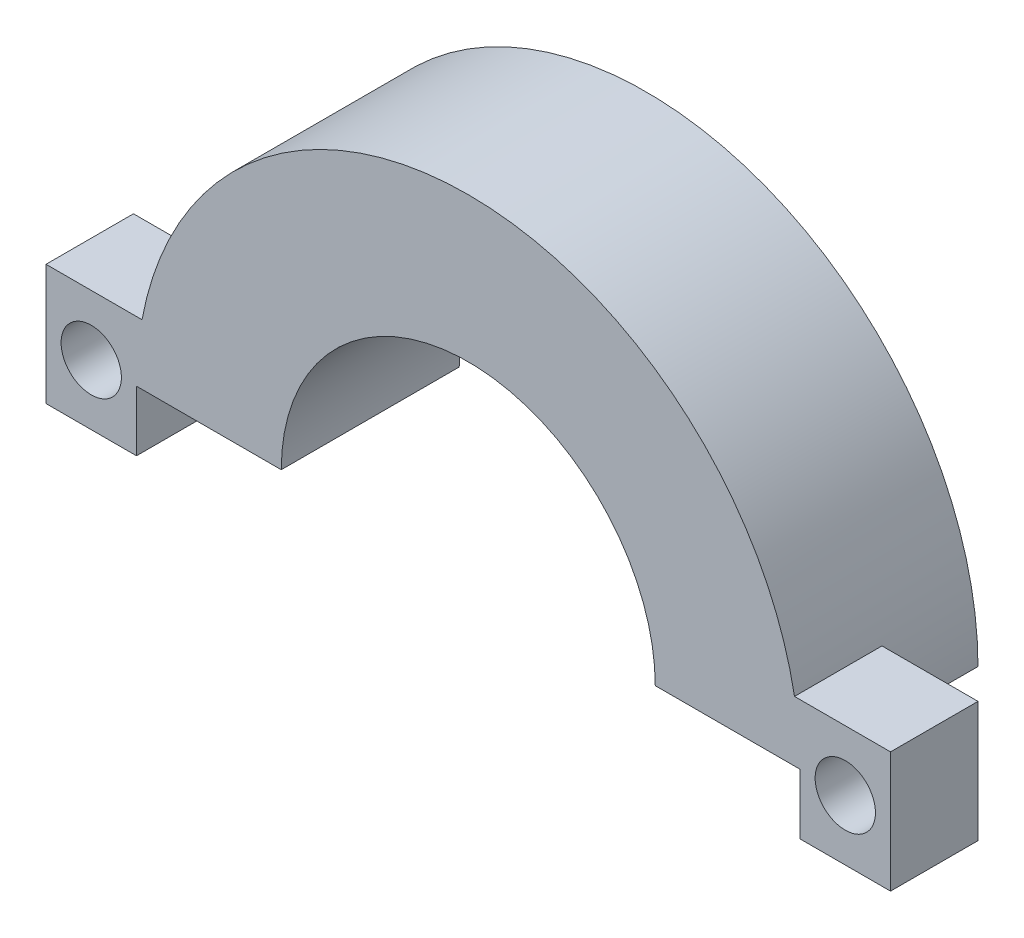
ISO-10303-21;
HEADER;
FILE_DESCRIPTION(('STEP AP214'),'2;1');
FILE_NAME('part.step','',(''),(''),'','','');
FILE_SCHEMA(('AUTOMOTIVE_DESIGN { 1 0 10303 214 1 1 1 1 }'));
ENDSEC;
DATA;
#1=APPLICATION_CONTEXT('core data for automotive mechanical design processes');
#2=APPLICATION_PROTOCOL_DEFINITION('international standard','automotive_design',2000,#1);
#3=PRODUCT_CONTEXT('',#1,'mechanical');
#4=PRODUCT('Part','Part','',(#3));
#5=PRODUCT_RELATED_PRODUCT_CATEGORY('part','',(#4));
#6=PRODUCT_DEFINITION_FORMATION('','',#4);
#7=PRODUCT_DEFINITION_CONTEXT('part definition',#1,'design');
#8=PRODUCT_DEFINITION('design','',#6,#7);
#9=PRODUCT_DEFINITION_SHAPE('','',#8);
#10=(LENGTH_UNIT() NAMED_UNIT(*) SI_UNIT(.MILLI.,.METRE.));
#11=(NAMED_UNIT(*) PLANE_ANGLE_UNIT() SI_UNIT($,.RADIAN.));
#12=(NAMED_UNIT(*) SI_UNIT($,.STERADIAN.) SOLID_ANGLE_UNIT());
#13=UNCERTAINTY_MEASURE_WITH_UNIT(LENGTH_MEASURE(1.E-05),#10,'distance_accuracy_value','');
#14=(GEOMETRIC_REPRESENTATION_CONTEXT(3) GLOBAL_UNCERTAINTY_ASSIGNED_CONTEXT((#13)) GLOBAL_UNIT_ASSIGNED_CONTEXT((#10,
#11,#12)) REPRESENTATION_CONTEXT('',''));
#15=CARTESIAN_POINT('',(0.,0.,0.));
#16=DIRECTION('',(0.,0.,1.));
#17=DIRECTION('',(1.,0.,0.));
#18=AXIS2_PLACEMENT_3D('',#15,#16,#17);
#19=CARTESIAN_POINT('',(7.56323897211495,0.,5.9));
#20=DIRECTION('',(0.,0.,-1.));
#21=DIRECTION('',(-1.,0.,0.));
#22=AXIS2_PLACEMENT_3D('',#19,#20,#21);
#23=CYLINDRICAL_SURFACE('',#22,11.);
#24=CARTESIAN_POINT('',(7.56323897211495,0.,5.9));
#25=DIRECTION('',(0.,0.,1.));
#26=DIRECTION('',(1.,0.,0.));
#27=AXIS2_PLACEMENT_3D('',#24,#25,#26);
#28=CIRCLE('',#27,11.);
#29=CARTESIAN_POINT('',(-3.25341485427702,2.,5.9));
#30=VERTEX_POINT('',#29);
#31=CARTESIAN_POINT('',(18.3798927985069,2.,5.9));
#32=VERTEX_POINT('',#31);
#33=EDGE_CURVE('E67',#30,#32,#28,.F.);
#34=ORIENTED_EDGE('',*,*,#33,.T.);
#35=DIRECTION('',(0.,0.,-1.));
#36=VECTOR('',#35,1.);
#37=CARTESIAN_POINT('',(18.3798927985069,2.,5.9));
#38=LINE('',#37,#36);
#39=CARTESIAN_POINT('',(18.3798927985069,2.,3.));
#40=VERTEX_POINT('',#39);
#41=EDGE_CURVE('E62',#32,#40,#38,.T.);
#42=ORIENTED_EDGE('',*,*,#41,.T.);
#43=CARTESIAN_POINT('',(7.56323897211495,0.,3.));
#44=DIRECTION('',(0.,0.,1.));
#45=DIRECTION('',(1.,0.,0.));
#46=AXIS2_PLACEMENT_3D('',#43,#44,#45);
#47=CIRCLE('',#46,11.);
#48=CARTESIAN_POINT('',(18.563238972115,0.,3.));
#49=VERTEX_POINT('',#48);
#50=EDGE_CURVE('E147',#40,#49,#47,.F.);
#51=ORIENTED_EDGE('',*,*,#50,.T.);
#52=DIRECTION('',(0.,0.,-1.));
#53=VECTOR('',#52,1.);
#54=CARTESIAN_POINT('',(18.563238972115,0.,5.9));
#55=LINE('',#54,#53);
#56=CARTESIAN_POINT('',(18.563238972115,0.,0.));
#57=VERTEX_POINT('',#56);
#58=EDGE_CURVE('E268',#49,#57,#55,.T.);
#59=ORIENTED_EDGE('',*,*,#58,.T.);
#60=CARTESIAN_POINT('',(7.56323897211495,0.,0.));
#61=DIRECTION('',(0.,0.,1.));
#62=DIRECTION('',(1.,0.,0.));
#63=AXIS2_PLACEMENT_3D('',#60,#61,#62);
#64=CIRCLE('',#63,11.);
#65=CARTESIAN_POINT('',(-3.43676102788505,0.,0.));
#66=VERTEX_POINT('',#65);
#67=EDGE_CURVE('E247',#66,#57,#64,.F.);
#68=ORIENTED_EDGE('',*,*,#67,.F.);
#69=DIRECTION('',(0.,0.,-1.));
#70=VECTOR('',#69,1.);
#71=CARTESIAN_POINT('',(-3.43676102788505,0.,5.9));
#72=LINE('',#71,#70);
#73=CARTESIAN_POINT('',(-3.43676102788505,0.,3.));
#74=VERTEX_POINT('',#73);
#75=EDGE_CURVE('E253',#74,#66,#72,.T.);
#76=ORIENTED_EDGE('',*,*,#75,.F.);
#77=CARTESIAN_POINT('',(7.56323897211495,0.,3.));
#78=DIRECTION('',(0.,0.,1.));
#79=DIRECTION('',(1.,0.,0.));
#80=AXIS2_PLACEMENT_3D('',#77,#78,#79);
#81=CIRCLE('',#80,11.);
#82=CARTESIAN_POINT('',(-3.25341485427702,2.,3.));
#83=VERTEX_POINT('',#82);
#84=EDGE_CURVE('E11',#74,#83,#81,.F.);
#85=ORIENTED_EDGE('',*,*,#84,.T.);
#86=DIRECTION('',(0.,0.,-1.));
#87=VECTOR('',#86,1.);
#88=CARTESIAN_POINT('',(-3.25341485427702,2.,5.9));
#89=LINE('',#88,#87);
#90=EDGE_CURVE('E234',#83,#30,#89,.F.);
#91=ORIENTED_EDGE('',*,*,#90,.T.);
#92=EDGE_LOOP('',(#34,#42,#51,#59,#68,#76,#85,#91));
#93=FACE_BOUND('',#92,.T.);
#94=ADVANCED_FACE('F44',(#93),#23,.T.);
#95=CARTESIAN_POINT('',(0.,0.,5.9));
#96=DIRECTION('',(0.,1.,0.));
#97=DIRECTION('',(0.,0.,1.));
#98=AXIS2_PLACEMENT_3D('',#95,#96,#97);
#99=PLANE('',#98);
#100=DIRECTION('',(0.,0.,-1.));
#101=VECTOR('',#100,1.);
#102=CARTESIAN_POINT('',(1.36323897211495,0.,5.9));
#103=LINE('',#102,#101);
#104=CARTESIAN_POINT('',(1.36323897211495,0.,5.9));
#105=VERTEX_POINT('',#104);
#106=CARTESIAN_POINT('',(1.36323897211495,0.,0.));
#107=VERTEX_POINT('',#106);
#108=EDGE_CURVE('E54',#105,#107,#103,.T.);
#109=ORIENTED_EDGE('',*,*,#108,.F.);
#110=DIRECTION('',(1.,0.,0.));
#111=VECTOR('',#110,1.);
#112=CARTESIAN_POINT('',(0.,0.,5.9));
#113=LINE('',#112,#111);
#114=CARTESIAN_POINT('',(-3.43676102788505,0.,5.9));
#115=VERTEX_POINT('',#114);
#116=EDGE_CURVE('E243',#115,#105,#113,.T.);
#117=ORIENTED_EDGE('',*,*,#116,.F.);
#118=EDGE_CURVE('E264',#115,#74,#72,.T.);
#119=ORIENTED_EDGE('',*,*,#118,.T.);
#120=ORIENTED_EDGE('',*,*,#75,.T.);
#121=DIRECTION('',(1.,0.,0.));
#122=VECTOR('',#121,1.);
#123=CARTESIAN_POINT('',(0.,0.,0.));
#124=LINE('',#123,#122);
#125=EDGE_CURVE('E242',#66,#107,#124,.T.);
#126=ORIENTED_EDGE('',*,*,#125,.T.);
#127=EDGE_LOOP('',(#109,#117,#119,#120,#126));
#128=FACE_BOUND('',#127,.T.);
#129=ADVANCED_FACE('F340',(#128),#99,.F.);
#130=CARTESIAN_POINT('',(7.56323897211495,0.,5.9));
#131=DIRECTION('',(0.,0.,-1.));
#132=DIRECTION('',(-1.,0.,0.));
#133=AXIS2_PLACEMENT_3D('',#130,#131,#132);
#134=CYLINDRICAL_SURFACE('',#133,6.2);
#135=CARTESIAN_POINT('',(7.56323897211495,0.,0.));
#136=DIRECTION('',(0.,0.,1.));
#137=DIRECTION('',(1.,0.,0.));
#138=AXIS2_PLACEMENT_3D('',#135,#136,#137);
#139=CIRCLE('',#138,6.2);
#140=CARTESIAN_POINT('',(13.763238972115,0.,0.));
#141=VERTEX_POINT('',#140);
#142=EDGE_CURVE('E257',#107,#141,#139,.F.);
#143=ORIENTED_EDGE('',*,*,#142,.T.);
#144=DIRECTION('',(0.,0.,-1.));
#145=VECTOR('',#144,1.);
#146=CARTESIAN_POINT('',(13.763238972115,0.,5.9));
#147=LINE('',#146,#145);
#148=CARTESIAN_POINT('',(13.763238972115,0.,5.9));
#149=VERTEX_POINT('',#148);
#150=EDGE_CURVE('E273',#149,#141,#147,.T.);
#151=ORIENTED_EDGE('',*,*,#150,.F.);
#152=CARTESIAN_POINT('',(7.56323897211495,0.,5.9));
#153=DIRECTION('',(0.,0.,1.));
#154=DIRECTION('',(1.,0.,0.));
#155=AXIS2_PLACEMENT_3D('',#152,#153,#154);
#156=CIRCLE('',#155,6.2);
#157=EDGE_CURVE('E246',#105,#149,#156,.F.);
#158=ORIENTED_EDGE('',*,*,#157,.F.);
#159=ORIENTED_EDGE('',*,*,#108,.T.);
#160=EDGE_LOOP('',(#143,#151,#158,#159));
#161=FACE_BOUND('',#160,.T.);
#162=ADVANCED_FACE('F46',(#161),#134,.F.);
#163=CARTESIAN_POINT('',(18.563238972115,0.,5.9));
#164=VERTEX_POINT('',#163);
#165=EDGE_CURVE('E269',#164,#49,#55,.T.);
#166=ORIENTED_EDGE('',*,*,#165,.F.);
#167=EDGE_CURVE('E248',#149,#164,#113,.T.);
#168=ORIENTED_EDGE('',*,*,#167,.F.);
#169=ORIENTED_EDGE('',*,*,#150,.T.);
#170=EDGE_CURVE('E258',#141,#57,#124,.T.);
#171=ORIENTED_EDGE('',*,*,#170,.T.);
#172=ORIENTED_EDGE('',*,*,#58,.F.);
#173=EDGE_LOOP('',(#166,#168,#169,#171,#172));
#174=FACE_BOUND('',#173,.T.);
#175=ADVANCED_FACE('F302',(#174),#99,.F.);
#176=CARTESIAN_POINT('',(0.,0.,5.9));
#177=DIRECTION('',(0.,0.,1.));
#178=DIRECTION('',(1.,0.,0.));
#179=AXIS2_PLACEMENT_3D('',#176,#177,#178);
#180=PLANE('',#179);
#181=CARTESIAN_POINT('',(20.063238972115,0.,5.9));
#182=DIRECTION('',(0.,0.,1.));
#183=DIRECTION('',(1.,0.,0.));
#184=AXIS2_PLACEMENT_3D('',#181,#182,#183);
#185=CIRCLE('',#184,1.);
#186=CARTESIAN_POINT('',(21.063238972115,0.,5.9));
#187=VERTEX_POINT('',#186);
#188=EDGE_CURVE('E282',#187,#187,#185,.T.);
#189=ORIENTED_EDGE('',*,*,#188,.F.);
#190=EDGE_LOOP('',(#189));
#191=FACE_BOUND('',#190,.T.);
#192=CARTESIAN_POINT('',(-4.93676102788505,0.,5.9));
#193=DIRECTION('',(0.,0.,1.));
#194=DIRECTION('',(1.,0.,0.));
#195=AXIS2_PLACEMENT_3D('',#192,#193,#194);
#196=CIRCLE('',#195,1.);
#197=CARTESIAN_POINT('',(-3.93676102788505,0.,5.9));
#198=VERTEX_POINT('',#197);
#199=EDGE_CURVE('E175',#198,#198,#196,.T.);
#200=ORIENTED_EDGE('',*,*,#199,.F.);
#201=EDGE_LOOP('',(#200));
#202=FACE_BOUND('',#201,.T.);
#203=ORIENTED_EDGE('',*,*,#167,.T.);
#204=DIRECTION('',(0.,-1.,0.));
#205=VECTOR('',#204,1.);
#206=CARTESIAN_POINT('',(18.563238972115,0.,5.9));
#207=LINE('',#206,#205);
#208=CARTESIAN_POINT('',(18.563238972115,-2.,5.9));
#209=VERTEX_POINT('',#208);
#210=EDGE_CURVE('E172',#164,#209,#207,.T.);
#211=ORIENTED_EDGE('',*,*,#210,.T.);
#212=DIRECTION('',(1.,0.,0.));
#213=VECTOR('',#212,1.);
#214=CARTESIAN_POINT('',(0.,-2.,5.9));
#215=LINE('',#214,#213);
#216=CARTESIAN_POINT('',(21.563238972115,-2.,5.9));
#217=VERTEX_POINT('',#216);
#218=EDGE_CURVE('E168',#209,#217,#215,.T.);
#219=ORIENTED_EDGE('',*,*,#218,.T.);
#220=DIRECTION('',(0.,-1.,0.));
#221=VECTOR('',#220,1.);
#222=CARTESIAN_POINT('',(21.563238972115,0.,5.9));
#223=LINE('',#222,#221);
#224=CARTESIAN_POINT('',(21.563238972115,2.,5.9));
#225=VERTEX_POINT('',#224);
#226=EDGE_CURVE('E183',#225,#217,#223,.T.);
#227=ORIENTED_EDGE('',*,*,#226,.F.);
#228=DIRECTION('',(1.,0.,0.));
#229=VECTOR('',#228,1.);
#230=CARTESIAN_POINT('',(0.,2.,5.9));
#231=LINE('',#230,#229);
#232=EDGE_CURVE('E156',#32,#225,#231,.T.);
#233=ORIENTED_EDGE('',*,*,#232,.F.);
#234=ORIENTED_EDGE('',*,*,#33,.F.);
#235=DIRECTION('',(1.,0.,0.));
#236=VECTOR('',#235,1.);
#237=CARTESIAN_POINT('',(0.,2.,5.9));
#238=LINE('',#237,#236);
#239=CARTESIAN_POINT('',(-6.43676102788505,2.,5.9));
#240=VERTEX_POINT('',#239);
#241=EDGE_CURVE('E205',#240,#30,#238,.T.);
#242=ORIENTED_EDGE('',*,*,#241,.F.);
#243=DIRECTION('',(0.,-1.,0.));
#244=VECTOR('',#243,1.);
#245=CARTESIAN_POINT('',(-6.43676102788505,0.,5.9));
#246=LINE('',#245,#244);
#247=CARTESIAN_POINT('',(-6.43676102788505,-2.,5.9));
#248=VERTEX_POINT('',#247);
#249=EDGE_CURVE('E199',#240,#248,#246,.T.);
#250=ORIENTED_EDGE('',*,*,#249,.T.);
#251=DIRECTION('',(1.,0.,0.));
#252=VECTOR('',#251,1.);
#253=CARTESIAN_POINT('',(0.,-2.,5.9));
#254=LINE('',#253,#252);
#255=CARTESIAN_POINT('',(-3.43676102788505,-2.,5.9));
#256=VERTEX_POINT('',#255);
#257=EDGE_CURVE('E220',#248,#256,#254,.T.);
#258=ORIENTED_EDGE('',*,*,#257,.T.);
#259=DIRECTION('',(0.,-1.,0.));
#260=VECTOR('',#259,1.);
#261=CARTESIAN_POINT('',(-3.43676102788505,0.,5.9));
#262=LINE('',#261,#260);
#263=EDGE_CURVE('E224',#115,#256,#262,.T.);
#264=ORIENTED_EDGE('',*,*,#263,.F.);
#265=ORIENTED_EDGE('',*,*,#116,.T.);
#266=ORIENTED_EDGE('',*,*,#157,.T.);
#267=EDGE_LOOP('',(#203,#211,#219,#227,#233,#234,#242,#250,#258,#264,#265,#266));
#268=FACE_BOUND('',#267,.T.);
#269=ADVANCED_FACE('F298',(#191,#202,#268),#180,.T.);
#270=CARTESIAN_POINT('',(0.,0.,0.));
#271=DIRECTION('',(0.,0.,1.));
#272=DIRECTION('',(1.,0.,0.));
#273=AXIS2_PLACEMENT_3D('',#270,#271,#272);
#274=PLANE('',#273);
#275=ORIENTED_EDGE('',*,*,#125,.F.);
#276=ORIENTED_EDGE('',*,*,#67,.T.);
#277=ORIENTED_EDGE('',*,*,#170,.F.);
#278=ORIENTED_EDGE('',*,*,#142,.F.);
#279=EDGE_LOOP('',(#275,#276,#277,#278));
#280=FACE_BOUND('',#279,.T.);
#281=ADVANCED_FACE('F301',(#280),#274,.F.);
#282=CARTESIAN_POINT('',(-6.43676102788505,0.,3.));
#283=DIRECTION('',(-1.,0.,0.));
#284=DIRECTION('',(0.,0.,1.));
#285=AXIS2_PLACEMENT_3D('',#282,#283,#284);
#286=PLANE('',#285);
#287=ORIENTED_EDGE('',*,*,#249,.F.);
#288=DIRECTION('',(0.,0.,1.));
#289=VECTOR('',#288,1.);
#290=CARTESIAN_POINT('',(-6.43676102788505,2.,3.));
#291=LINE('',#290,#289);
#292=CARTESIAN_POINT('',(-6.43676102788505,2.,3.));
#293=VERTEX_POINT('',#292);
#294=EDGE_CURVE('E231',#293,#240,#291,.T.);
#295=ORIENTED_EDGE('',*,*,#294,.F.);
#296=DIRECTION('',(0.,-1.,0.));
#297=VECTOR('',#296,1.);
#298=CARTESIAN_POINT('',(-6.43676102788505,0.,3.));
#299=LINE('',#298,#297);
#300=CARTESIAN_POINT('',(-6.43676102788505,-2.,3.));
#301=VERTEX_POINT('',#300);
#302=EDGE_CURVE('E200',#293,#301,#299,.T.);
#303=ORIENTED_EDGE('',*,*,#302,.T.);
#304=DIRECTION('',(0.,0.,1.));
#305=VECTOR('',#304,1.);
#306=CARTESIAN_POINT('',(-6.43676102788505,-2.,3.));
#307=LINE('',#306,#305);
#308=EDGE_CURVE('E216',#301,#248,#307,.T.);
#309=ORIENTED_EDGE('',*,*,#308,.T.);
#310=EDGE_LOOP('',(#287,#295,#303,#309));
#311=FACE_BOUND('',#310,.T.);
#312=ADVANCED_FACE('F327',(#311),#286,.T.);
#313=CARTESIAN_POINT('',(0.,2.,3.));
#314=DIRECTION('',(0.,-1.,0.));
#315=DIRECTION('',(0.,0.,-1.));
#316=AXIS2_PLACEMENT_3D('',#313,#314,#315);
#317=PLANE('',#316);
#318=ORIENTED_EDGE('',*,*,#90,.F.);
#319=DIRECTION('',(1.,0.,0.));
#320=VECTOR('',#319,1.);
#321=CARTESIAN_POINT('',(0.,2.,3.));
#322=LINE('',#321,#320);
#323=EDGE_CURVE('E212',#293,#83,#322,.T.);
#324=ORIENTED_EDGE('',*,*,#323,.F.);
#325=ORIENTED_EDGE('',*,*,#294,.T.);
#326=ORIENTED_EDGE('',*,*,#241,.T.);
#327=EDGE_LOOP('',(#318,#324,#325,#326));
#328=FACE_BOUND('',#327,.T.);
#329=ADVANCED_FACE('F324',(#328),#317,.F.);
#330=CARTESIAN_POINT('',(-3.43676102788505,0.,3.));
#331=DIRECTION('',(-1.,0.,0.));
#332=DIRECTION('',(0.,-1.,0.));
#333=AXIS2_PLACEMENT_3D('',#330,#331,#332);
#334=PLANE('',#333);
#335=ORIENTED_EDGE('',*,*,#263,.T.);
#336=DIRECTION('',(0.,0.,1.));
#337=VECTOR('',#336,1.);
#338=CARTESIAN_POINT('',(-3.43676102788505,-2.,3.));
#339=LINE('',#338,#337);
#340=CARTESIAN_POINT('',(-3.43676102788505,-2.,3.));
#341=VERTEX_POINT('',#340);
#342=EDGE_CURVE('E235',#341,#256,#339,.T.);
#343=ORIENTED_EDGE('',*,*,#342,.F.);
#344=DIRECTION('',(0.,-1.,0.));
#345=VECTOR('',#344,1.);
#346=CARTESIAN_POINT('',(-3.43676102788505,0.,3.));
#347=LINE('',#346,#345);
#348=EDGE_CURVE('E209',#74,#341,#347,.T.);
#349=ORIENTED_EDGE('',*,*,#348,.F.);
#350=ORIENTED_EDGE('',*,*,#118,.F.);
#351=EDGE_LOOP('',(#335,#343,#349,#350));
#352=FACE_BOUND('',#351,.T.);
#353=ADVANCED_FACE('F337',(#352),#334,.F.);
#354=CARTESIAN_POINT('',(0.,-2.,3.));
#355=DIRECTION('',(0.,-1.,0.));
#356=DIRECTION('',(0.,0.,-1.));
#357=AXIS2_PLACEMENT_3D('',#354,#355,#356);
#358=PLANE('',#357);
#359=ORIENTED_EDGE('',*,*,#257,.F.);
#360=ORIENTED_EDGE('',*,*,#308,.F.);
#361=DIRECTION('',(1.,0.,0.));
#362=VECTOR('',#361,1.);
#363=CARTESIAN_POINT('',(0.,-2.,3.));
#364=LINE('',#363,#362);
#365=EDGE_CURVE('E204',#301,#341,#364,.T.);
#366=ORIENTED_EDGE('',*,*,#365,.T.);
#367=ORIENTED_EDGE('',*,*,#342,.T.);
#368=EDGE_LOOP('',(#359,#360,#366,#367));
#369=FACE_BOUND('',#368,.T.);
#370=ADVANCED_FACE('F331',(#369),#358,.T.);
#371=CARTESIAN_POINT('',(0.,0.,3.));
#372=DIRECTION('',(0.,0.,1.));
#373=DIRECTION('',(1.,0.,0.));
#374=AXIS2_PLACEMENT_3D('',#371,#372,#373);
#375=PLANE('',#374);
#376=CARTESIAN_POINT('',(-4.93676102788505,0.,3.));
#377=DIRECTION('',(0.,0.,1.));
#378=DIRECTION('',(1.,0.,0.));
#379=AXIS2_PLACEMENT_3D('',#376,#377,#378);
#380=CIRCLE('',#379,1.);
#381=CARTESIAN_POINT('',(-3.93676102788505,0.,3.));
#382=VERTEX_POINT('',#381);
#383=EDGE_CURVE('E48',#382,#382,#380,.T.);
#384=ORIENTED_EDGE('',*,*,#383,.T.);
#385=EDGE_LOOP('',(#384));
#386=FACE_BOUND('',#385,.T.);
#387=ORIENTED_EDGE('',*,*,#84,.F.);
#388=ORIENTED_EDGE('',*,*,#348,.T.);
#389=ORIENTED_EDGE('',*,*,#365,.F.);
#390=ORIENTED_EDGE('',*,*,#302,.F.);
#391=ORIENTED_EDGE('',*,*,#323,.T.);
#392=EDGE_LOOP('',(#387,#388,#389,#390,#391));
#393=FACE_BOUND('',#392,.T.);
#394=ADVANCED_FACE('F343',(#386,#393),#375,.F.);
#395=CARTESIAN_POINT('',(21.563238972115,0.,3.));
#396=DIRECTION('',(-1.,0.,0.));
#397=DIRECTION('',(0.,0.,1.));
#398=AXIS2_PLACEMENT_3D('',#395,#396,#397);
#399=PLANE('',#398);
#400=ORIENTED_EDGE('',*,*,#226,.T.);
#401=DIRECTION('',(0.,0.,1.));
#402=VECTOR('',#401,1.);
#403=CARTESIAN_POINT('',(21.563238972115,-2.,3.));
#404=LINE('',#403,#402);
#405=CARTESIAN_POINT('',(21.563238972115,-2.,3.));
#406=VERTEX_POINT('',#405);
#407=EDGE_CURVE('E165',#406,#217,#404,.T.);
#408=ORIENTED_EDGE('',*,*,#407,.F.);
#409=DIRECTION('',(0.,-1.,0.));
#410=VECTOR('',#409,1.);
#411=CARTESIAN_POINT('',(21.563238972115,0.,3.));
#412=LINE('',#411,#410);
#413=CARTESIAN_POINT('',(21.563238972115,2.,3.));
#414=VERTEX_POINT('',#413);
#415=EDGE_CURVE('E144',#414,#406,#412,.T.);
#416=ORIENTED_EDGE('',*,*,#415,.F.);
#417=DIRECTION('',(0.,0.,1.));
#418=VECTOR('',#417,1.);
#419=CARTESIAN_POINT('',(21.563238972115,2.,3.));
#420=LINE('',#419,#418);
#421=EDGE_CURVE('E153',#414,#225,#420,.T.);
#422=ORIENTED_EDGE('',*,*,#421,.T.);
#423=EDGE_LOOP('',(#400,#408,#416,#422));
#424=FACE_BOUND('',#423,.T.);
#425=ADVANCED_FACE('F164',(#424),#399,.F.);
#426=CARTESIAN_POINT('',(0.,-2.,3.));
#427=DIRECTION('',(0.,-1.,0.));
#428=DIRECTION('',(0.,0.,-1.));
#429=AXIS2_PLACEMENT_3D('',#426,#427,#428);
#430=PLANE('',#429);
#431=ORIENTED_EDGE('',*,*,#218,.F.);
#432=DIRECTION('',(0.,0.,1.));
#433=VECTOR('',#432,1.);
#434=CARTESIAN_POINT('',(18.563238972115,-2.,3.));
#435=LINE('',#434,#433);
#436=CARTESIAN_POINT('',(18.563238972115,-2.,3.));
#437=VERTEX_POINT('',#436);
#438=EDGE_CURVE('E161',#437,#209,#435,.T.);
#439=ORIENTED_EDGE('',*,*,#438,.F.);
#440=DIRECTION('',(1.,0.,0.));
#441=VECTOR('',#440,1.);
#442=CARTESIAN_POINT('',(0.,-2.,3.));
#443=LINE('',#442,#441);
#444=EDGE_CURVE('E162',#437,#406,#443,.T.);
#445=ORIENTED_EDGE('',*,*,#444,.T.);
#446=ORIENTED_EDGE('',*,*,#407,.T.);
#447=EDGE_LOOP('',(#431,#439,#445,#446));
#448=FACE_BOUND('',#447,.T.);
#449=ADVANCED_FACE('F317',(#448),#430,.T.);
#450=CARTESIAN_POINT('',(18.563238972115,0.,3.));
#451=DIRECTION('',(-1.,0.,0.));
#452=DIRECTION('',(0.,0.,1.));
#453=AXIS2_PLACEMENT_3D('',#450,#451,#452);
#454=PLANE('',#453);
#455=ORIENTED_EDGE('',*,*,#210,.F.);
#456=ORIENTED_EDGE('',*,*,#165,.T.);
#457=DIRECTION('',(0.,-1.,0.));
#458=VECTOR('',#457,1.);
#459=CARTESIAN_POINT('',(18.563238972115,0.,3.));
#460=LINE('',#459,#458);
#461=EDGE_CURVE('E150',#49,#437,#460,.T.);
#462=ORIENTED_EDGE('',*,*,#461,.T.);
#463=ORIENTED_EDGE('',*,*,#438,.T.);
#464=EDGE_LOOP('',(#455,#456,#462,#463));
#465=FACE_BOUND('',#464,.T.);
#466=ADVANCED_FACE('F315',(#465),#454,.T.);
#467=CARTESIAN_POINT('',(0.,2.,3.));
#468=DIRECTION('',(0.,-1.,0.));
#469=DIRECTION('',(1.,0.,0.));
#470=AXIS2_PLACEMENT_3D('',#467,#468,#469);
#471=PLANE('',#470);
#472=ORIENTED_EDGE('',*,*,#41,.F.);
#473=ORIENTED_EDGE('',*,*,#232,.T.);
#474=ORIENTED_EDGE('',*,*,#421,.F.);
#475=DIRECTION('',(1.,0.,0.));
#476=VECTOR('',#475,1.);
#477=CARTESIAN_POINT('',(0.,2.,3.));
#478=LINE('',#477,#476);
#479=EDGE_CURVE('E139',#40,#414,#478,.T.);
#480=ORIENTED_EDGE('',*,*,#479,.F.);
#481=EDGE_LOOP('',(#472,#473,#474,#480));
#482=FACE_BOUND('',#481,.T.);
#483=ADVANCED_FACE('F154',(#482),#471,.F.);
#484=CARTESIAN_POINT('',(0.,0.,3.));
#485=DIRECTION('',(0.,0.,1.));
#486=DIRECTION('',(1.,0.,0.));
#487=AXIS2_PLACEMENT_3D('',#484,#485,#486);
#488=PLANE('',#487);
#489=CARTESIAN_POINT('',(20.063238972115,0.,3.));
#490=DIRECTION('',(0.,0.,1.));
#491=DIRECTION('',(1.,0.,0.));
#492=AXIS2_PLACEMENT_3D('',#489,#490,#491);
#493=CIRCLE('',#492,1.);
#494=CARTESIAN_POINT('',(21.063238972115,0.,3.));
#495=VERTEX_POINT('',#494);
#496=EDGE_CURVE('E279',#495,#495,#493,.T.);
#497=ORIENTED_EDGE('',*,*,#496,.T.);
#498=EDGE_LOOP('',(#497));
#499=FACE_BOUND('',#498,.T.);
#500=ORIENTED_EDGE('',*,*,#50,.F.);
#501=ORIENTED_EDGE('',*,*,#479,.T.);
#502=ORIENTED_EDGE('',*,*,#415,.T.);
#503=ORIENTED_EDGE('',*,*,#444,.F.);
#504=ORIENTED_EDGE('',*,*,#461,.F.);
#505=EDGE_LOOP('',(#500,#501,#502,#503,#504));
#506=FACE_BOUND('',#505,.T.);
#507=ADVANCED_FACE('F141',(#499,#506),#488,.F.);
#508=CARTESIAN_POINT('',(20.063238972115,0.,-0.6));
#509=DIRECTION('',(0.,0.,1.));
#510=DIRECTION('',(1.,0.,0.));
#511=AXIS2_PLACEMENT_3D('',#508,#509,#510);
#512=CYLINDRICAL_SURFACE('',#511,1.);
#513=ORIENTED_EDGE('',*,*,#188,.T.);
#514=EDGE_LOOP('',(#513));
#515=FACE_BOUND('',#514,.T.);
#516=ORIENTED_EDGE('',*,*,#496,.F.);
#517=EDGE_LOOP('',(#516));
#518=FACE_BOUND('',#517,.T.);
#519=ADVANCED_FACE('F449',(#515,#518),#512,.F.);
#520=CARTESIAN_POINT('',(-4.93676102788505,0.,-0.6));
#521=DIRECTION('',(0.,0.,1.));
#522=DIRECTION('',(1.,0.,0.));
#523=AXIS2_PLACEMENT_3D('',#520,#521,#522);
#524=CYLINDRICAL_SURFACE('',#523,1.);
#525=ORIENTED_EDGE('',*,*,#199,.T.);
#526=EDGE_LOOP('',(#525));
#527=FACE_BOUND('',#526,.T.);
#528=ORIENTED_EDGE('',*,*,#383,.F.);
#529=EDGE_LOOP('',(#528));
#530=FACE_BOUND('',#529,.T.);
#531=ADVANCED_FACE('F295',(#527,#530),#524,.F.);
#532=CLOSED_SHELL('',(#94,#129,#162,#175,#269,#281,#312,#329,#353,#370,#394,#425,#449,#466,#483,
#507,#519,#531));
#533=MANIFOLD_SOLID_BREP('B2',#532);
#534=ADVANCED_BREP_SHAPE_REPRESENTATION('',(#18,#533),#14);
#535=SHAPE_DEFINITION_REPRESENTATION(#9,#534);
ENDSEC;
END-ISO-10303-21;
